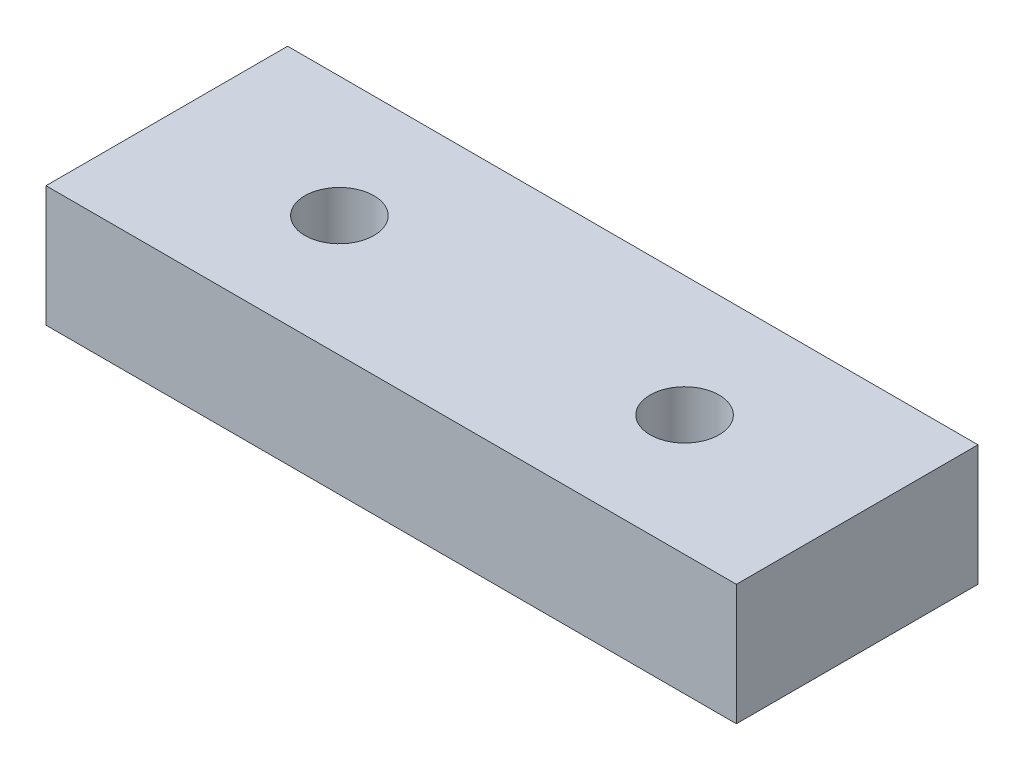
ISO-10303-21;
HEADER;
FILE_DESCRIPTION(('STEP AP214'),'2;1');
FILE_NAME('part.step','',(''),(''),'','','');
FILE_SCHEMA(('AUTOMOTIVE_DESIGN { 1 0 10303 214 1 1 1 1 }'));
ENDSEC;
DATA;
#1=APPLICATION_CONTEXT('core data for automotive mechanical design processes');
#2=APPLICATION_PROTOCOL_DEFINITION('international standard','automotive_design',2000,#1);
#3=PRODUCT_CONTEXT('',#1,'mechanical');
#4=PRODUCT('Part','Part','',(#3));
#5=PRODUCT_RELATED_PRODUCT_CATEGORY('part','',(#4));
#6=PRODUCT_DEFINITION_FORMATION('','',#4);
#7=PRODUCT_DEFINITION_CONTEXT('part definition',#1,'design');
#8=PRODUCT_DEFINITION('design','',#6,#7);
#9=PRODUCT_DEFINITION_SHAPE('','',#8);
#10=(LENGTH_UNIT() NAMED_UNIT(*) SI_UNIT(.MILLI.,.METRE.));
#11=(NAMED_UNIT(*) PLANE_ANGLE_UNIT() SI_UNIT($,.RADIAN.));
#12=(NAMED_UNIT(*) SI_UNIT($,.STERADIAN.) SOLID_ANGLE_UNIT());
#13=UNCERTAINTY_MEASURE_WITH_UNIT(LENGTH_MEASURE(1.E-05),#10,'distance_accuracy_value','');
#14=(GEOMETRIC_REPRESENTATION_CONTEXT(3) GLOBAL_UNCERTAINTY_ASSIGNED_CONTEXT((#13)) GLOBAL_UNIT_ASSIGNED_CONTEXT((#10,
#11,#12)) REPRESENTATION_CONTEXT('',''));
#15=CARTESIAN_POINT('',(0.,0.,0.));
#16=DIRECTION('',(0.,0.,1.));
#17=DIRECTION('',(1.,0.,0.));
#18=AXIS2_PLACEMENT_3D('',#15,#16,#17);
#19=CARTESIAN_POINT('',(0.,3.5,0.));
#20=DIRECTION('',(0.,-1.,0.));
#21=DIRECTION('',(0.,0.,-1.));
#22=AXIS2_PLACEMENT_3D('',#19,#20,#21);
#23=PLANE('',#22);
#24=DIRECTION('',(0.,0.,1.));
#25=VECTOR('',#24,1.);
#26=CARTESIAN_POINT('',(0.,3.5,0.));
#27=LINE('',#26,#25);
#28=CARTESIAN_POINT('',(0.,3.5,-7.));
#29=VERTEX_POINT('',#28);
#30=CARTESIAN_POINT('',(0.,3.5,0.));
#31=VERTEX_POINT('',#30);
#32=EDGE_CURVE('E92',#29,#31,#27,.T.);
#33=ORIENTED_EDGE('',*,*,#32,.T.);
#34=DIRECTION('',(1.,0.,0.));
#35=VECTOR('',#34,1.);
#36=CARTESIAN_POINT('',(0.,3.5,0.));
#37=LINE('',#36,#35);
#38=CARTESIAN_POINT('',(20.,3.5,0.));
#39=VERTEX_POINT('',#38);
#40=EDGE_CURVE('E87',#31,#39,#37,.T.);
#41=ORIENTED_EDGE('',*,*,#40,.T.);
#42=DIRECTION('',(0.,0.,-1.));
#43=VECTOR('',#42,1.);
#44=CARTESIAN_POINT('',(20.,3.5,0.));
#45=LINE('',#44,#43);
#46=CARTESIAN_POINT('',(20.,3.5,-7.));
#47=VERTEX_POINT('',#46);
#48=EDGE_CURVE('E90',#39,#47,#45,.T.);
#49=ORIENTED_EDGE('',*,*,#48,.T.);
#50=DIRECTION('',(-1.,0.,0.));
#51=VECTOR('',#50,1.);
#52=CARTESIAN_POINT('',(0.,3.5,-7.));
#53=LINE('',#52,#51);
#54=EDGE_CURVE('E57',#47,#29,#53,.T.);
#55=ORIENTED_EDGE('',*,*,#54,.T.);
#56=EDGE_LOOP('',(#33,#41,#49,#55));
#57=FACE_BOUND('',#56,.T.);
#58=CARTESIAN_POINT('',(5.,3.5,-3.5));
#59=DIRECTION('',(0.,1.,0.));
#60=DIRECTION('',(0.,0.,1.));
#61=AXIS2_PLACEMENT_3D('',#58,#59,#60);
#62=CIRCLE('',#61,1.);
#63=CARTESIAN_POINT('',(5.,3.5,-2.5));
#64=VERTEX_POINT('',#63);
#65=EDGE_CURVE('E112',#64,#64,#62,.T.);
#66=ORIENTED_EDGE('',*,*,#65,.F.);
#67=EDGE_LOOP('',(#66));
#68=FACE_BOUND('',#67,.T.);
#69=CARTESIAN_POINT('',(15.,3.5,-3.5));
#70=DIRECTION('',(0.,1.,0.));
#71=DIRECTION('',(0.,0.,1.));
#72=AXIS2_PLACEMENT_3D('',#69,#70,#71);
#73=CIRCLE('',#72,1.);
#74=CARTESIAN_POINT('',(15.,3.5,-2.5));
#75=VERTEX_POINT('',#74);
#76=EDGE_CURVE('E134',#75,#75,#73,.T.);
#77=ORIENTED_EDGE('',*,*,#76,.F.);
#78=EDGE_LOOP('',(#77));
#79=FACE_BOUND('',#78,.T.);
#80=ADVANCED_FACE('F39',(#57,#68,#79),#23,.F.);
#81=CARTESIAN_POINT('',(0.,0.,0.));
#82=DIRECTION('',(0.,-1.,0.));
#83=DIRECTION('',(0.,0.,-1.));
#84=AXIS2_PLACEMENT_3D('',#81,#82,#83);
#85=PLANE('',#84);
#86=CARTESIAN_POINT('',(5.,0.,-3.5));
#87=DIRECTION('',(0.,1.,0.));
#88=DIRECTION('',(0.,0.,1.));
#89=AXIS2_PLACEMENT_3D('',#86,#87,#88);
#90=CIRCLE('',#89,1.);
#91=CARTESIAN_POINT('',(5.,0.,-2.5));
#92=VERTEX_POINT('',#91);
#93=EDGE_CURVE('E130',#92,#92,#90,.T.);
#94=ORIENTED_EDGE('',*,*,#93,.T.);
#95=EDGE_LOOP('',(#94));
#96=FACE_BOUND('',#95,.T.);
#97=DIRECTION('',(0.,0.,1.));
#98=VECTOR('',#97,1.);
#99=CARTESIAN_POINT('',(0.,0.,0.));
#100=LINE('',#99,#98);
#101=CARTESIAN_POINT('',(0.,0.,-7.));
#102=VERTEX_POINT('',#101);
#103=CARTESIAN_POINT('',(0.,0.,0.));
#104=VERTEX_POINT('',#103);
#105=EDGE_CURVE('E108',#102,#104,#100,.T.);
#106=ORIENTED_EDGE('',*,*,#105,.F.);
#107=DIRECTION('',(-1.,0.,0.));
#108=VECTOR('',#107,1.);
#109=CARTESIAN_POINT('',(0.,0.,-7.));
#110=LINE('',#109,#108);
#111=CARTESIAN_POINT('',(20.,0.,-7.));
#112=VERTEX_POINT('',#111);
#113=EDGE_CURVE('E80',#112,#102,#110,.T.);
#114=ORIENTED_EDGE('',*,*,#113,.F.);
#115=DIRECTION('',(0.,0.,-1.));
#116=VECTOR('',#115,1.);
#117=CARTESIAN_POINT('',(20.,0.,0.));
#118=LINE('',#117,#116);
#119=CARTESIAN_POINT('',(20.,0.,0.));
#120=VERTEX_POINT('',#119);
#121=EDGE_CURVE('E74',#120,#112,#118,.T.);
#122=ORIENTED_EDGE('',*,*,#121,.F.);
#123=DIRECTION('',(1.,0.,0.));
#124=VECTOR('',#123,1.);
#125=CARTESIAN_POINT('',(0.,0.,0.));
#126=LINE('',#125,#124);
#127=EDGE_CURVE('E97',#104,#120,#126,.T.);
#128=ORIENTED_EDGE('',*,*,#127,.F.);
#129=EDGE_LOOP('',(#106,#114,#122,#128));
#130=FACE_BOUND('',#129,.T.);
#131=CARTESIAN_POINT('',(15.,0.,-3.5));
#132=DIRECTION('',(0.,1.,0.));
#133=DIRECTION('',(0.,0.,1.));
#134=AXIS2_PLACEMENT_3D('',#131,#132,#133);
#135=CIRCLE('',#134,1.);
#136=CARTESIAN_POINT('',(15.,0.,-2.5));
#137=VERTEX_POINT('',#136);
#138=EDGE_CURVE('E138',#137,#137,#135,.T.);
#139=ORIENTED_EDGE('',*,*,#138,.T.);
#140=EDGE_LOOP('',(#139));
#141=FACE_BOUND('',#140,.T.);
#142=ADVANCED_FACE('F125',(#96,#130,#141),#85,.T.);
#143=CARTESIAN_POINT('',(0.,3.5,0.));
#144=DIRECTION('',(1.,0.,0.));
#145=DIRECTION('',(0.,0.,-1.));
#146=AXIS2_PLACEMENT_3D('',#143,#144,#145);
#147=PLANE('',#146);
#148=ORIENTED_EDGE('',*,*,#105,.T.);
#149=DIRECTION('',(0.,-1.,0.));
#150=VECTOR('',#149,1.);
#151=CARTESIAN_POINT('',(0.,3.5,0.));
#152=LINE('',#151,#150);
#153=EDGE_CURVE('E11',#31,#104,#152,.T.);
#154=ORIENTED_EDGE('',*,*,#153,.F.);
#155=ORIENTED_EDGE('',*,*,#32,.F.);
#156=DIRECTION('',(0.,-1.,0.));
#157=VECTOR('',#156,1.);
#158=CARTESIAN_POINT('',(0.,3.5,-7.));
#159=LINE('',#158,#157);
#160=EDGE_CURVE('E104',#29,#102,#159,.T.);
#161=ORIENTED_EDGE('',*,*,#160,.T.);
#162=EDGE_LOOP('',(#148,#154,#155,#161));
#163=FACE_BOUND('',#162,.T.);
#164=ADVANCED_FACE('F41',(#163),#147,.F.);
#165=CARTESIAN_POINT('',(0.,3.5,0.));
#166=DIRECTION('',(0.,0.,-1.));
#167=DIRECTION('',(-1.,0.,0.));
#168=AXIS2_PLACEMENT_3D('',#165,#166,#167);
#169=PLANE('',#168);
#170=ORIENTED_EDGE('',*,*,#127,.T.);
#171=DIRECTION('',(0.,-1.,0.));
#172=VECTOR('',#171,1.);
#173=CARTESIAN_POINT('',(20.,3.5,0.));
#174=LINE('',#173,#172);
#175=EDGE_CURVE('E49',#39,#120,#174,.T.);
#176=ORIENTED_EDGE('',*,*,#175,.F.);
#177=ORIENTED_EDGE('',*,*,#40,.F.);
#178=ORIENTED_EDGE('',*,*,#153,.T.);
#179=EDGE_LOOP('',(#170,#176,#177,#178));
#180=FACE_BOUND('',#179,.T.);
#181=ADVANCED_FACE('F96',(#180),#169,.F.);
#182=CARTESIAN_POINT('',(20.,3.5,0.));
#183=DIRECTION('',(-1.,0.,0.));
#184=DIRECTION('',(0.,0.,1.));
#185=AXIS2_PLACEMENT_3D('',#182,#183,#184);
#186=PLANE('',#185);
#187=ORIENTED_EDGE('',*,*,#121,.T.);
#188=DIRECTION('',(0.,-1.,0.));
#189=VECTOR('',#188,1.);
#190=CARTESIAN_POINT('',(20.,3.5,-7.));
#191=LINE('',#190,#189);
#192=EDGE_CURVE('E99',#47,#112,#191,.T.);
#193=ORIENTED_EDGE('',*,*,#192,.F.);
#194=ORIENTED_EDGE('',*,*,#48,.F.);
#195=ORIENTED_EDGE('',*,*,#175,.T.);
#196=EDGE_LOOP('',(#187,#193,#194,#195));
#197=FACE_BOUND('',#196,.T.);
#198=ADVANCED_FACE('F100',(#197),#186,.F.);
#199=CARTESIAN_POINT('',(0.,3.5,-7.));
#200=DIRECTION('',(0.,0.,1.));
#201=DIRECTION('',(1.,0.,0.));
#202=AXIS2_PLACEMENT_3D('',#199,#200,#201);
#203=PLANE('',#202);
#204=ORIENTED_EDGE('',*,*,#113,.T.);
#205=ORIENTED_EDGE('',*,*,#160,.F.);
#206=ORIENTED_EDGE('',*,*,#54,.F.);
#207=ORIENTED_EDGE('',*,*,#192,.T.);
#208=EDGE_LOOP('',(#204,#205,#206,#207));
#209=FACE_BOUND('',#208,.T.);
#210=ADVANCED_FACE('F122',(#209),#203,.F.);
#211=CARTESIAN_POINT('',(5.,3.5,-3.5));
#212=DIRECTION('',(0.,-1.,0.));
#213=DIRECTION('',(0.,0.,-1.));
#214=AXIS2_PLACEMENT_3D('',#211,#212,#213);
#215=CYLINDRICAL_SURFACE('',#214,1.);
#216=ORIENTED_EDGE('',*,*,#65,.T.);
#217=EDGE_LOOP('',(#216));
#218=FACE_BOUND('',#217,.T.);
#219=ORIENTED_EDGE('',*,*,#93,.F.);
#220=EDGE_LOOP('',(#219));
#221=FACE_BOUND('',#220,.T.);
#222=ADVANCED_FACE('F157',(#218,#221),#215,.F.);
#223=CARTESIAN_POINT('',(15.,3.5,-3.5));
#224=DIRECTION('',(0.,-1.,0.));
#225=DIRECTION('',(0.,0.,-1.));
#226=AXIS2_PLACEMENT_3D('',#223,#224,#225);
#227=CYLINDRICAL_SURFACE('',#226,1.);
#228=ORIENTED_EDGE('',*,*,#76,.T.);
#229=EDGE_LOOP('',(#228));
#230=FACE_BOUND('',#229,.T.);
#231=ORIENTED_EDGE('',*,*,#138,.F.);
#232=EDGE_LOOP('',(#231));
#233=FACE_BOUND('',#232,.T.);
#234=ADVANCED_FACE('F146',(#230,#233),#227,.F.);
#235=CLOSED_SHELL('',(#80,#142,#164,#181,#198,#210,#222,#234));
#236=MANIFOLD_SOLID_BREP('B2',#235);
#237=ADVANCED_BREP_SHAPE_REPRESENTATION('',(#18,#236),#14);
#238=SHAPE_DEFINITION_REPRESENTATION(#9,#237);
ENDSEC;
END-ISO-10303-21;
